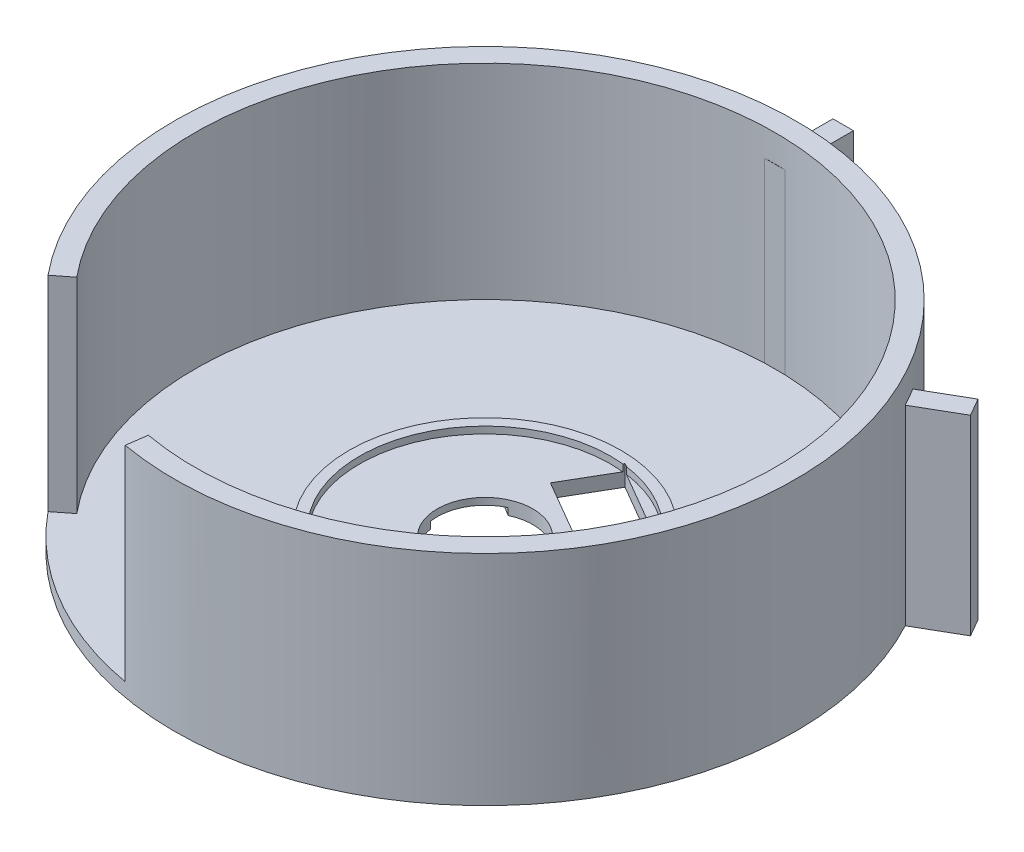
ISO-10303-21;
HEADER;
FILE_DESCRIPTION(('STEP AP214'),'2;1');
FILE_NAME('part.step','',(''),(''),'','','');
FILE_SCHEMA(('AUTOMOTIVE_DESIGN { 1 0 10303 214 1 1 1 1 }'));
ENDSEC;
DATA;
#1=APPLICATION_CONTEXT('core data for automotive mechanical design processes');
#2=APPLICATION_PROTOCOL_DEFINITION('international standard','automotive_design',2000,#1);
#3=PRODUCT_CONTEXT('',#1,'mechanical');
#4=PRODUCT('Part','Part','',(#3));
#5=PRODUCT_RELATED_PRODUCT_CATEGORY('part','',(#4));
#6=PRODUCT_DEFINITION_FORMATION('','',#4);
#7=PRODUCT_DEFINITION_CONTEXT('part definition',#1,'design');
#8=PRODUCT_DEFINITION('design','',#6,#7);
#9=PRODUCT_DEFINITION_SHAPE('','',#8);
#10=(LENGTH_UNIT() NAMED_UNIT(*) SI_UNIT(.MILLI.,.METRE.));
#11=(NAMED_UNIT(*) PLANE_ANGLE_UNIT() SI_UNIT($,.RADIAN.));
#12=(NAMED_UNIT(*) SI_UNIT($,.STERADIAN.) SOLID_ANGLE_UNIT());
#13=UNCERTAINTY_MEASURE_WITH_UNIT(LENGTH_MEASURE(1.E-05),#10,'distance_accuracy_value','');
#14=(GEOMETRIC_REPRESENTATION_CONTEXT(3) GLOBAL_UNCERTAINTY_ASSIGNED_CONTEXT((#13)) GLOBAL_UNIT_ASSIGNED_CONTEXT((#10,
#11,#12)) REPRESENTATION_CONTEXT('',''));
#15=CARTESIAN_POINT('',(0.,0.,0.));
#16=DIRECTION('',(0.,0.,1.));
#17=DIRECTION('',(1.,0.,0.));
#18=AXIS2_PLACEMENT_3D('',#15,#16,#17);
#19=CARTESIAN_POINT('',(0.,32.,0.));
#20=DIRECTION('',(0.,-1.,0.));
#21=DIRECTION('',(0.,0.,-1.));
#22=AXIS2_PLACEMENT_3D('',#19,#20,#21);
#23=CYLINDRICAL_SURFACE('',#22,42.5);
#24=CARTESIAN_POINT('',(0.,32.,0.));
#25=DIRECTION('',(0.,1.,0.));
#26=DIRECTION('',(0.,0.,1.));
#27=AXIS2_PLACEMENT_3D('',#24,#25,#26);
#28=CIRCLE('',#27,42.5);
#29=CARTESIAN_POINT('',(-7.50818253214453,32.,41.8315335012237));
#30=VERTEX_POINT('',#29);
#31=CARTESIAN_POINT('',(-32.8004509650978,32.,27.0255511782131));
#32=VERTEX_POINT('',#31);
#33=EDGE_CURVE('E461',#30,#32,#28,.T.);
#34=ORIENTED_EDGE('',*,*,#33,.T.);
#35=DIRECTION('',(0.,-1.,0.));
#36=VECTOR('',#35,1.);
#37=CARTESIAN_POINT('',(-32.8004509650978,32.,27.0255511782131));
#38=LINE('',#37,#36);
#39=CARTESIAN_POINT('',(-32.8004509650978,2.,27.0255511782131));
#40=VERTEX_POINT('',#39);
#41=EDGE_CURVE('E282',#32,#40,#38,.T.);
#42=ORIENTED_EDGE('',*,*,#41,.T.);
#43=CARTESIAN_POINT('',(0.,2.,0.));
#44=DIRECTION('',(0.,-1.,0.));
#45=DIRECTION('',(0.,0.,-1.));
#46=AXIS2_PLACEMENT_3D('',#43,#44,#45);
#47=CIRCLE('',#46,42.5);
#48=CARTESIAN_POINT('',(-1.49999999999974,2.,-42.4735211631906));
#49=VERTEX_POINT('',#48);
#50=EDGE_CURVE('E457',#40,#49,#47,.T.);
#51=ORIENTED_EDGE('',*,*,#50,.T.);
#52=DIRECTION('',(0.,1.,0.));
#53=VECTOR('',#52,1.);
#54=CARTESIAN_POINT('',(-1.49999999999974,0.,-42.4735211631906));
#55=LINE('',#54,#53);
#56=CARTESIAN_POINT('',(-1.49999999999974,28.,-42.4735211631906));
#57=VERTEX_POINT('',#56);
#58=EDGE_CURVE('E431',#49,#57,#55,.T.);
#59=ORIENTED_EDGE('',*,*,#58,.T.);
#60=CARTESIAN_POINT('',(0.,28.,0.));
#61=DIRECTION('',(0.,-1.,0.));
#62=DIRECTION('',(0.,0.,-1.));
#63=AXIS2_PLACEMENT_3D('',#60,#61,#62);
#64=CIRCLE('',#63,42.5);
#65=CARTESIAN_POINT('',(1.50000000000026,28.,-42.4735211631906));
#66=VERTEX_POINT('',#65);
#67=EDGE_CURVE('E450',#57,#66,#64,.T.);
#68=ORIENTED_EDGE('',*,*,#67,.T.);
#69=DIRECTION('',(0.,1.,0.));
#70=VECTOR('',#69,1.);
#71=CARTESIAN_POINT('',(1.50000000000026,0.,-42.4735211631906));
#72=LINE('',#71,#70);
#73=CARTESIAN_POINT('',(1.50000000000026,2.,-42.4735211631906));
#74=VERTEX_POINT('',#73);
#75=EDGE_CURVE('E430',#74,#66,#72,.T.);
#76=ORIENTED_EDGE('',*,*,#75,.F.);
#77=CARTESIAN_POINT('',(36.0331483154992,2.,-22.5357986872717));
#78=VERTEX_POINT('',#77);
#79=EDGE_CURVE('E466',#74,#78,#47,.T.);
#80=ORIENTED_EDGE('',*,*,#79,.T.);
#81=DIRECTION('',(0.,1.,0.));
#82=VECTOR('',#81,1.);
#83=CARTESIAN_POINT('',(36.0331483154992,0.,-22.5357986872717));
#84=LINE('',#83,#82);
#85=CARTESIAN_POINT('',(36.0331483154992,28.,-22.5357986872717));
#86=VERTEX_POINT('',#85);
#87=EDGE_CURVE('E381',#78,#86,#84,.T.);
#88=ORIENTED_EDGE('',*,*,#87,.T.);
#89=CARTESIAN_POINT('',(0.,28.,0.));
#90=DIRECTION('',(0.,-1.,0.));
#91=DIRECTION('',(0.,0.,-1.));
#92=AXIS2_PLACEMENT_3D('',#89,#90,#91);
#93=CIRCLE('',#92,42.5);
#94=CARTESIAN_POINT('',(37.5331483154988,28.,-19.9377224759191));
#95=VERTEX_POINT('',#94);
#96=EDGE_CURVE('E400',#86,#95,#93,.T.);
#97=ORIENTED_EDGE('',*,*,#96,.T.);
#98=DIRECTION('',(0.,1.,0.));
#99=VECTOR('',#98,1.);
#100=CARTESIAN_POINT('',(37.5331483154988,0.,-19.9377224759191));
#101=LINE('',#100,#99);
#102=CARTESIAN_POINT('',(37.5331483154988,2.,-19.9377224759191));
#103=VERTEX_POINT('',#102);
#104=EDGE_CURVE('E380',#103,#95,#101,.T.);
#105=ORIENTED_EDGE('',*,*,#104,.F.);
#106=CARTESIAN_POINT('',(-7.50818253214453,2.,41.8315335012237));
#107=VERTEX_POINT('',#106);
#108=EDGE_CURVE('E478',#103,#107,#47,.T.);
#109=ORIENTED_EDGE('',*,*,#108,.T.);
#110=DIRECTION('',(0.,-1.,0.));
#111=VECTOR('',#110,1.);
#112=CARTESIAN_POINT('',(-7.50818253214453,32.,41.8315335012237));
#113=LINE('',#112,#111);
#114=EDGE_CURVE('E274',#107,#30,#113,.F.);
#115=ORIENTED_EDGE('',*,*,#114,.T.);
#116=EDGE_LOOP('',(#34,#42,#51,#59,#68,#76,#80,#88,#97,#105,#109,#115));
#117=FACE_BOUND('',#116,.T.);
#118=ADVANCED_FACE('F39',(#117),#23,.F.);
#119=CARTESIAN_POINT('',(0.,32.,0.));
#120=DIRECTION('',(0.,1.,0.));
#121=DIRECTION('',(0.,0.,1.));
#122=AXIS2_PLACEMENT_3D('',#119,#120,#121);
#123=PLANE('',#122);
#124=CARTESIAN_POINT('',(0.,32.,0.));
#125=DIRECTION('',(0.,1.,0.));
#126=DIRECTION('',(0.,0.,1.));
#127=AXIS2_PLACEMENT_3D('',#124,#125,#126);
#128=CIRCLE('',#127,45.5);
#129=CARTESIAN_POINT('',(-7.92598309635751,32.,44.8043389858198));
#130=VERTEX_POINT('',#129);
#131=CARTESIAN_POINT('',(-35.1652264960856,32.,28.8731163104886));
#132=VERTEX_POINT('',#131);
#133=EDGE_CURVE('E467',#130,#132,#128,.T.);
#134=ORIENTED_EDGE('',*,*,#133,.T.);
#135=DIRECTION('',(0.788010753606721,0.,-0.61566147532566));
#136=VECTOR('',#135,1.);
#137=CARTESIAN_POINT('',(0.678736558687916,32.,0.868743178756121));
#138=LINE('',#137,#136);
#139=EDGE_CURVE('E278',#132,#32,#138,.T.);
#140=ORIENTED_EDGE('',*,*,#139,.T.);
#141=ORIENTED_EDGE('',*,*,#33,.F.);
#142=DIRECTION('',(-0.139173100960061,0.,0.990268068741571));
#143=VECTOR('',#142,1.);
#144=CARTESIAN_POINT('',(-1.59758876118056,32.,-0.224526458007468));
#145=LINE('',#144,#143);
#146=EDGE_CURVE('E270',#30,#130,#145,.T.);
#147=ORIENTED_EDGE('',*,*,#146,.T.);
#148=EDGE_LOOP('',(#134,#140,#141,#147));
#149=FACE_BOUND('',#148,.T.);
#150=ADVANCED_FACE('F526',(#149),#123,.T.);
#151=CARTESIAN_POINT('',(0.,32.,0.));
#152=DIRECTION('',(0.,-1.,0.));
#153=DIRECTION('',(0.,0.,-1.));
#154=AXIS2_PLACEMENT_3D('',#151,#152,#153);
#155=CYLINDRICAL_SURFACE('',#154,45.5);
#156=CARTESIAN_POINT('',(0.,28.,0.));
#157=DIRECTION('',(0.,-1.,0.));
#158=DIRECTION('',(0.,0.,-1.));
#159=AXIS2_PLACEMENT_3D('',#156,#157,#158);
#160=CIRCLE('',#159,45.5);
#161=CARTESIAN_POINT('',(38.6327373350306,28.,-24.0366721074805));
#162=VERTEX_POINT('',#161);
#163=CARTESIAN_POINT('',(40.1327373350302,28.,-21.438595896128));
#164=VERTEX_POINT('',#163);
#165=EDGE_CURVE('E490',#162,#164,#160,.T.);
#166=ORIENTED_EDGE('',*,*,#165,.F.);
#167=DIRECTION('',(0.,-1.,0.));
#168=VECTOR('',#167,1.);
#169=CARTESIAN_POINT('',(38.6327373350306,32.,-24.0366721074805));
#170=LINE('',#169,#168);
#171=CARTESIAN_POINT('',(38.6327373350306,0.,-24.0366721074805));
#172=VERTEX_POINT('',#171);
#173=EDGE_CURVE('E397',#162,#172,#170,.T.);
#174=ORIENTED_EDGE('',*,*,#173,.T.);
#175=CARTESIAN_POINT('',(0.,0.,0.));
#176=DIRECTION('',(0.,1.,0.));
#177=DIRECTION('',(0.,0.,1.));
#178=AXIS2_PLACEMENT_3D('',#175,#176,#177);
#179=CIRCLE('',#178,45.5);
#180=CARTESIAN_POINT('',(1.50000000000027,0.,-45.4752680036083));
#181=VERTEX_POINT('',#180);
#182=EDGE_CURVE('E465',#172,#181,#179,.T.);
#183=ORIENTED_EDGE('',*,*,#182,.T.);
#184=DIRECTION('',(0.,-1.,0.));
#185=VECTOR('',#184,1.);
#186=CARTESIAN_POINT('',(1.50000000000027,32.,-45.4752680036083));
#187=LINE('',#186,#185);
#188=CARTESIAN_POINT('',(1.50000000000027,28.,-45.4752680036083));
#189=VERTEX_POINT('',#188);
#190=EDGE_CURVE('E435',#181,#189,#187,.F.);
#191=ORIENTED_EDGE('',*,*,#190,.T.);
#192=CARTESIAN_POINT('',(0.,28.,0.));
#193=DIRECTION('',(0.,-1.,0.));
#194=DIRECTION('',(0.,0.,-1.));
#195=AXIS2_PLACEMENT_3D('',#192,#193,#194);
#196=CIRCLE('',#195,45.5);
#197=CARTESIAN_POINT('',(-1.49999999999972,28.,-45.4752680036083));
#198=VERTEX_POINT('',#197);
#199=EDGE_CURVE('E482',#198,#189,#196,.T.);
#200=ORIENTED_EDGE('',*,*,#199,.F.);
#201=DIRECTION('',(0.,-1.,0.));
#202=VECTOR('',#201,1.);
#203=CARTESIAN_POINT('',(-1.49999999999972,32.,-45.4752680036083));
#204=LINE('',#203,#202);
#205=CARTESIAN_POINT('',(-1.49999999999972,0.,-45.4752680036083));
#206=VERTEX_POINT('',#205);
#207=EDGE_CURVE('E447',#198,#206,#204,.T.);
#208=ORIENTED_EDGE('',*,*,#207,.T.);
#209=CARTESIAN_POINT('',(40.1327373350302,0.,-21.438595896128));
#210=VERTEX_POINT('',#209);
#211=EDGE_CURVE('E472',#206,#210,#179,.T.);
#212=ORIENTED_EDGE('',*,*,#211,.T.);
#213=DIRECTION('',(0.,-1.,0.));
#214=VECTOR('',#213,1.);
#215=CARTESIAN_POINT('',(40.1327373350302,32.,-21.438595896128));
#216=LINE('',#215,#214);
#217=EDGE_CURVE('E385',#210,#164,#216,.F.);
#218=ORIENTED_EDGE('',*,*,#217,.T.);
#219=EDGE_LOOP('',(#166,#174,#183,#191,#200,#208,#212,#218));
#220=FACE_BOUND('',#219,.T.);
#221=DIRECTION('',(0.,-1.,0.));
#222=VECTOR('',#221,1.);
#223=CARTESIAN_POINT('',(-35.1652264960856,60.5,28.8731163104886));
#224=LINE('',#223,#222);
#225=CARTESIAN_POINT('',(-35.1652264960856,2.,28.8731163104886));
#226=VERTEX_POINT('',#225);
#227=EDGE_CURVE('E267',#132,#226,#224,.T.);
#228=ORIENTED_EDGE('',*,*,#227,.F.);
#229=ORIENTED_EDGE('',*,*,#133,.F.);
#230=DIRECTION('',(0.,-1.,0.));
#231=VECTOR('',#230,1.);
#232=CARTESIAN_POINT('',(-7.92598309635751,60.5,44.8043389858198));
#233=LINE('',#232,#231);
#234=CARTESIAN_POINT('',(-7.92598309635751,2.,44.8043389858198));
#235=VERTEX_POINT('',#234);
#236=EDGE_CURVE('E263',#130,#235,#233,.T.);
#237=ORIENTED_EDGE('',*,*,#236,.T.);
#238=CARTESIAN_POINT('',(0.,2.,0.));
#239=DIRECTION('',(0.,-1.,0.));
#240=DIRECTION('',(0.,0.,-1.));
#241=AXIS2_PLACEMENT_3D('',#238,#239,#240);
#242=CIRCLE('',#241,45.5);
#243=EDGE_CURVE('E231',#235,#226,#242,.T.);
#244=ORIENTED_EDGE('',*,*,#243,.T.);
#245=EDGE_LOOP('',(#228,#229,#237,#244));
#246=FACE_BOUND('',#245,.T.);
#247=ADVANCED_FACE('F41',(#220,#246),#155,.T.);
#248=CARTESIAN_POINT('',(0.,2.,0.));
#249=DIRECTION('',(0.,-1.,0.));
#250=DIRECTION('',(0.,0.,-1.));
#251=AXIS2_PLACEMENT_3D('',#248,#249,#250);
#252=PLANE('',#251);
#253=CARTESIAN_POINT('',(0.,2.,0.));
#254=DIRECTION('',(0.,1.,0.));
#255=DIRECTION('',(0.,0.,1.));
#256=AXIS2_PLACEMENT_3D('',#253,#254,#255);
#257=CIRCLE('',#256,7.);
#258=CARTESIAN_POINT('',(0.,2.,7.));
#259=VERTEX_POINT('',#258);
#260=EDGE_CURVE('E454',#259,#259,#257,.T.);
#261=ORIENTED_EDGE('',*,*,#260,.F.);
#262=EDGE_LOOP('',(#261));
#263=FACE_BOUND('',#262,.T.);
#264=DIRECTION('',(-0.864345338631781,0.,-0.502898732932895));
#265=VECTOR('',#264,1.);
#266=CARTESIAN_POINT('',(4.52608859639606,2.,-7.77910804768603));
#267=LINE('',#266,#265);
#268=CARTESIAN_POINT('',(10.9586774046728,2.,-4.03645957539663));
#269=VERTEX_POINT('',#268);
#270=CARTESIAN_POINT('',(-2.00650267480392,2.,-11.5799405693901));
#271=VERTEX_POINT('',#270);
#272=EDGE_CURVE('E336',#269,#271,#267,.T.);
#273=ORIENTED_EDGE('',*,*,#272,.T.);
#274=DIRECTION('',(0.502898732932895,0.,-0.864345338631781));
#275=VECTOR('',#274,1.);
#276=CARTESIAN_POINT('',(-6.53259127119998,2.,-3.80083252170404));
#277=LINE('',#276,#275);
#278=CARTESIAN_POINT('',(1.89868436966206,2.,-18.2918887158568));
#279=VERTEX_POINT('',#278);
#280=EDGE_CURVE('E332',#271,#279,#277,.T.);
#281=ORIENTED_EDGE('',*,*,#280,.T.);
#282=CARTESIAN_POINT('',(0.,2.,0.));
#283=DIRECTION('',(0.,1.,0.));
#284=DIRECTION('',(0.,0.,1.));
#285=AXIS2_PLACEMENT_3D('',#282,#283,#284);
#286=CIRCLE('',#285,18.3901657178201);
#287=CARTESIAN_POINT('',(14.8898530942682,2.,-10.7930750928546));
#288=VERTEX_POINT('',#287);
#289=EDGE_CURVE('E340',#279,#288,#286,.T.);
#290=ORIENTED_EDGE('',*,*,#289,.T.);
#291=DIRECTION('',(-0.502898732932895,0.,0.864345338631781));
#292=VECTOR('',#291,1.);
#293=CARTESIAN_POINT('',(6.43258880827674,2.,3.7426484722894));
#294=LINE('',#293,#292);
#295=EDGE_CURVE('E325',#288,#269,#294,.T.);
#296=ORIENTED_EDGE('',*,*,#295,.T.);
#297=EDGE_LOOP('',(#273,#281,#290,#296));
#298=FACE_BOUND('',#297,.T.);
#299=ADVANCED_FACE('F600',(#263,#298),#252,.F.);
#300=CARTESIAN_POINT('',(0.,3.,0.));
#301=DIRECTION('',(0.,-1.,0.));
#302=DIRECTION('',(0.,0.,-1.));
#303=AXIS2_PLACEMENT_3D('',#300,#301,#302);
#304=CYLINDRICAL_SURFACE('',#303,18.3901657178201);
#305=DIRECTION('',(0.,-1.,0.));
#306=VECTOR('',#305,1.);
#307=CARTESIAN_POINT('',(1.89868436966206,3.,-18.2918887158568));
#308=LINE('',#307,#306);
#309=CARTESIAN_POINT('',(1.89868436966206,3.,-18.2918887158568));
#310=VERTEX_POINT('',#309);
#311=EDGE_CURVE('E507',#310,#279,#308,.T.);
#312=ORIENTED_EDGE('',*,*,#311,.F.);
#313=CARTESIAN_POINT('',(0.,3.,0.));
#314=DIRECTION('',(0.,1.,0.));
#315=DIRECTION('',(0.,0.,1.));
#316=AXIS2_PLACEMENT_3D('',#313,#314,#315);
#317=CIRCLE('',#316,18.3901657178201);
#318=CARTESIAN_POINT('',(14.8898530942682,3.,-10.7930750928546));
#319=VERTEX_POINT('',#318);
#320=EDGE_CURVE('E341',#310,#319,#317,.T.);
#321=ORIENTED_EDGE('',*,*,#320,.T.);
#322=DIRECTION('',(0.,-1.,0.));
#323=VECTOR('',#322,1.);
#324=CARTESIAN_POINT('',(14.8898530942682,3.,-10.7930750928546));
#325=LINE('',#324,#323);
#326=EDGE_CURVE('E504',#288,#319,#325,.F.);
#327=ORIENTED_EDGE('',*,*,#326,.F.);
#328=ORIENTED_EDGE('',*,*,#289,.F.);
#329=EDGE_LOOP('',(#312,#321,#327,#328));
#330=FACE_BOUND('',#329,.T.);
#331=ADVANCED_FACE('F601',(#330),#304,.F.);
#332=CARTESIAN_POINT('',(14.6119198415396,2.,-11.1664673766285));
#333=VERTEX_POINT('',#332);
#334=CARTESIAN_POINT('',(2.48663707817889,2.,-18.221274136852));
#335=VERTEX_POINT('',#334);
#336=EDGE_CURVE('E346',#333,#335,#286,.T.);
#337=ORIENTED_EDGE('',*,*,#336,.T.);
#338=DIRECTION('',(0.864345338631781,0.,0.502898732932895));
#339=VECTOR('',#338,1.);
#340=CARTESIAN_POINT('',(8.54927845985922,2.,-14.6938707567403));
#341=LINE('',#340,#339);
#342=EDGE_CURVE('E317',#335,#333,#341,.T.);
#343=ORIENTED_EDGE('',*,*,#342,.T.);
#344=EDGE_LOOP('',(#337,#343));
#345=FACE_BOUND('',#344,.T.);
#346=ADVANCED_FACE('F594',(#345),#252,.F.);
#347=CARTESIAN_POINT('',(0.,0.,0.));
#348=DIRECTION('',(0.,1.,0.));
#349=DIRECTION('',(0.,0.,1.));
#350=AXIS2_PLACEMENT_3D('',#347,#348,#349);
#351=PLANE('',#350);
#352=DIRECTION('',(0.864345338631781,0.,0.502898732932895));
#353=VECTOR('',#352,1.);
#354=CARTESIAN_POINT('',(2.01668718865924,0.,-18.4947032784443));
#355=LINE('',#354,#353);
#356=CARTESIAN_POINT('',(2.01668718865924,0.,-18.4947032784443));
#357=VERTEX_POINT('',#356);
#358=CARTESIAN_POINT('',(14.981867268136,0.,-10.9512222844509));
#359=VERTEX_POINT('',#358);
#360=EDGE_CURVE('E289',#357,#359,#355,.T.);
#361=ORIENTED_EDGE('',*,*,#360,.F.);
#362=DIRECTION('',(0.502898732932895,0.,-0.864345338631781));
#363=VECTOR('',#362,1.);
#364=CARTESIAN_POINT('',(2.01668718865924,0.,-18.4947032784443));
#365=LINE('',#364,#363);
#366=CARTESIAN_POINT('',(-2.00650267480392,0.,-11.5799405693901));
#367=VERTEX_POINT('',#366);
#368=EDGE_CURVE('E286',#367,#357,#365,.T.);
#369=ORIENTED_EDGE('',*,*,#368,.F.);
#370=DIRECTION('',(-0.864345338631781,0.,-0.502898732932895));
#371=VECTOR('',#370,1.);
#372=CARTESIAN_POINT('',(-2.00650267480392,0.,-11.5799405693901));
#373=LINE('',#372,#371);
#374=CARTESIAN_POINT('',(10.9586774046728,0.,-4.03645957539663));
#375=VERTEX_POINT('',#374);
#376=EDGE_CURVE('E297',#375,#367,#373,.T.);
#377=ORIENTED_EDGE('',*,*,#376,.F.);
#378=DIRECTION('',(-0.502898732932896,0.,0.864345338631781));
#379=VECTOR('',#378,1.);
#380=CARTESIAN_POINT('',(14.981867268136,0.,-10.9512222844509));
#381=LINE('',#380,#379);
#382=EDGE_CURVE('E293',#359,#375,#381,.T.);
#383=ORIENTED_EDGE('',*,*,#382,.F.);
#384=EDGE_LOOP('',(#361,#369,#377,#383));
#385=FACE_BOUND('',#384,.T.);
#386=CARTESIAN_POINT('',(0.,0.,0.));
#387=DIRECTION('',(0.,1.,0.));
#388=DIRECTION('',(0.,0.,1.));
#389=AXIS2_PLACEMENT_3D('',#386,#387,#388);
#390=CIRCLE('',#389,7.);
#391=CARTESIAN_POINT('',(-6.91226534619207,0.,1.10480214691692));
#392=VERTEX_POINT('',#391);
#393=CARTESIAN_POINT('',(-2.96019924007833,0.,-6.34328152134522));
#394=VERTEX_POINT('',#393);
#395=EDGE_CURVE('E247',#392,#394,#390,.T.);
#396=ORIENTED_EDGE('',*,*,#395,.T.);
#397=DIRECTION('',(0.85293682845598,0.,0.522014144122028));
#398=VECTOR('',#397,1.);
#399=CARTESIAN_POINT('',(-2.51910953449813,0.,-6.07332593089862));
#400=LINE('',#399,#398);
#401=CARTESIAN_POINT('',(-19.8144830178494,0.,-16.6584352672208));
#402=VERTEX_POINT('',#401);
#403=EDGE_CURVE('E241',#402,#394,#400,.T.);
#404=ORIENTED_EDGE('',*,*,#403,.F.);
#405=DIRECTION('',(0.522014144122029,0.,-0.85293682845598));
#406=VECTOR('',#405,1.);
#407=CARTESIAN_POINT('',(-24.2076388295433,0.,-9.48030718940525));
#408=LINE('',#407,#406);
#409=CARTESIAN_POINT('',(-24.2076388295433,0.,-9.48030718940525));
#410=VERTEX_POINT('',#409);
#411=EDGE_CURVE('E611',#410,#402,#408,.T.);
#412=ORIENTED_EDGE('',*,*,#411,.F.);
#413=DIRECTION('',(-0.85293682845598,0.,-0.522014144122028));
#414=VECTOR('',#413,1.);
#415=CARTESIAN_POINT('',(-6.91226534619207,0.,1.10480214691692));
#416=LINE('',#415,#414);
#417=EDGE_CURVE('E609',#392,#410,#416,.T.);
#418=ORIENTED_EDGE('',*,*,#417,.F.);
#419=EDGE_LOOP('',(#396,#404,#412,#418));
#420=FACE_BOUND('',#419,.T.);
#421=ORIENTED_EDGE('',*,*,#182,.F.);
#422=DIRECTION('',(-0.866025403784438,0.,0.500000000000001));
#423=VECTOR('',#422,1.);
#424=CARTESIAN_POINT('',(44.6934023533436,0.,-27.5357986872717));
#425=LINE('',#424,#423);
#426=CARTESIAN_POINT('',(44.6934023533436,0.,-27.5357986872717));
#427=VERTEX_POINT('',#426);
#428=EDGE_CURVE('E376',#427,#172,#425,.T.);
#429=ORIENTED_EDGE('',*,*,#428,.F.);
#430=DIRECTION('',(-0.500000000000001,0.,-0.866025403784438));
#431=VECTOR('',#430,1.);
#432=CARTESIAN_POINT('',(46.1934023533432,0.,-24.9377224759191));
#433=LINE('',#432,#431);
#434=CARTESIAN_POINT('',(46.1934023533432,0.,-24.9377224759191));
#435=VERTEX_POINT('',#434);
#436=EDGE_CURVE('E372',#435,#427,#433,.T.);
#437=ORIENTED_EDGE('',*,*,#436,.F.);
#438=DIRECTION('',(0.866025403784438,0.,-0.500000000000001));
#439=VECTOR('',#438,1.);
#440=CARTESIAN_POINT('',(46.1934023533432,0.,-24.9377224759191));
#441=LINE('',#440,#439);
#442=EDGE_CURVE('E369',#210,#435,#441,.T.);
#443=ORIENTED_EDGE('',*,*,#442,.F.);
#444=ORIENTED_EDGE('',*,*,#211,.F.);
#445=DIRECTION('',(0.,0.,1.));
#446=VECTOR('',#445,1.);
#447=CARTESIAN_POINT('',(-1.49999999999968,0.,-52.4735211631906));
#448=LINE('',#447,#446);
#449=CARTESIAN_POINT('',(-1.49999999999968,0.,-52.4735211631906));
#450=VERTEX_POINT('',#449);
#451=EDGE_CURVE('E426',#450,#206,#448,.T.);
#452=ORIENTED_EDGE('',*,*,#451,.F.);
#453=DIRECTION('',(-1.,0.,0.));
#454=VECTOR('',#453,1.);
#455=CARTESIAN_POINT('',(1.50000000000032,0.,-52.4735211631906));
#456=LINE('',#455,#454);
#457=CARTESIAN_POINT('',(1.50000000000032,0.,-52.4735211631906));
#458=VERTEX_POINT('',#457);
#459=EDGE_CURVE('E422',#458,#450,#456,.T.);
#460=ORIENTED_EDGE('',*,*,#459,.F.);
#461=DIRECTION('',(0.,0.,-1.));
#462=VECTOR('',#461,1.);
#463=CARTESIAN_POINT('',(1.50000000000032,0.,-52.4735211631906));
#464=LINE('',#463,#462);
#465=EDGE_CURVE('E419',#181,#458,#464,.T.);
#466=ORIENTED_EDGE('',*,*,#465,.F.);
#467=EDGE_LOOP('',(#421,#429,#437,#443,#444,#452,#460,#466));
#468=FACE_BOUND('',#467,.T.);
#469=ADVANCED_FACE('F546',(#385,#420,#468),#351,.F.);
#470=ORIENTED_EDGE('',*,*,#50,.F.);
#471=DIRECTION('',(-0.788010753606721,0.,0.61566147532566));
#472=VECTOR('',#471,1.);
#473=CARTESIAN_POINT('',(-32.6066002919151,2.,26.8740984335667));
#474=LINE('',#473,#472);
#475=EDGE_CURVE('E63',#40,#226,#474,.T.);
#476=ORIENTED_EDGE('',*,*,#475,.T.);
#477=ORIENTED_EDGE('',*,*,#243,.F.);
#478=DIRECTION('',(0.139173100960061,0.,-0.990268068741571));
#479=VECTOR('',#478,1.);
#480=CARTESIAN_POINT('',(-7.49515502918447,2.,41.7388380011034));
#481=LINE('',#480,#479);
#482=EDGE_CURVE('E259',#235,#107,#481,.T.);
#483=ORIENTED_EDGE('',*,*,#482,.T.);
#484=ORIENTED_EDGE('',*,*,#108,.F.);
#485=DIRECTION('',(-0.500000000000004,0.,-0.866025403784437));
#486=VECTOR('',#485,1.);
#487=CARTESIAN_POINT('',(36.783148315499,2.,-21.2367605815955));
#488=LINE('',#487,#486);
#489=EDGE_CURVE('E486',#103,#78,#488,.T.);
#490=ORIENTED_EDGE('',*,*,#489,.T.);
#491=ORIENTED_EDGE('',*,*,#79,.F.);
#492=DIRECTION('',(-1.,0.,0.));
#493=VECTOR('',#492,1.);
#494=CARTESIAN_POINT('',(2.94719257076738E-13,2.,-42.4735211631906));
#495=LINE('',#494,#493);
#496=EDGE_CURVE('E471',#74,#49,#495,.T.);
#497=ORIENTED_EDGE('',*,*,#496,.T.);
#498=EDGE_LOOP('',(#470,#476,#477,#483,#484,#490,#491,#497));
#499=FACE_BOUND('',#498,.T.);
#500=CARTESIAN_POINT('',(0.,2.,0.));
#501=DIRECTION('',(0.,-1.,0.));
#502=DIRECTION('',(0.,0.,-1.));
#503=AXIS2_PLACEMENT_3D('',#500,#501,#502);
#504=CIRCLE('',#503,19.8901657178201);
#505=CARTESIAN_POINT('',(0.,2.,-19.8901657178201));
#506=VERTEX_POINT('',#505);
#507=EDGE_CURVE('E494',#506,#506,#504,.F.);
#508=ORIENTED_EDGE('',*,*,#507,.F.);
#509=EDGE_LOOP('',(#508));
#510=FACE_BOUND('',#509,.T.);
#511=ADVANCED_FACE('F516',(#499,#510),#252,.F.);
#512=CARTESIAN_POINT('',(0.,0.,0.));
#513=DIRECTION('',(0.,1.,0.));
#514=DIRECTION('',(0.,0.,1.));
#515=AXIS2_PLACEMENT_3D('',#512,#513,#514);
#516=CYLINDRICAL_SURFACE('',#515,7.);
#517=CARTESIAN_POINT('',(0.,1.,0.));
#518=DIRECTION('',(0.,1.,0.));
#519=DIRECTION('',(0.,0.,1.));
#520=AXIS2_PLACEMENT_3D('',#517,#518,#519);
#521=CIRCLE('',#520,7.);
#522=CARTESIAN_POINT('',(-6.91226534619207,1.,1.10480214691692));
#523=VERTEX_POINT('',#522);
#524=CARTESIAN_POINT('',(-2.96019924007833,1.,-6.34328152134522));
#525=VERTEX_POINT('',#524);
#526=EDGE_CURVE('E48',#523,#525,#521,.F.);
#527=ORIENTED_EDGE('',*,*,#526,.T.);
#528=DIRECTION('',(0.,1.,0.));
#529=VECTOR('',#528,1.);
#530=CARTESIAN_POINT('',(-2.96019924007833,0.,-6.34328152134522));
#531=LINE('',#530,#529);
#532=EDGE_CURVE('E11',#525,#394,#531,.F.);
#533=ORIENTED_EDGE('',*,*,#532,.T.);
#534=ORIENTED_EDGE('',*,*,#395,.F.);
#535=DIRECTION('',(0.,-1.,0.));
#536=VECTOR('',#535,1.);
#537=CARTESIAN_POINT('',(-6.91226534619207,1.,1.10480214691692));
#538=LINE('',#537,#536);
#539=EDGE_CURVE('E235',#523,#392,#538,.T.);
#540=ORIENTED_EDGE('',*,*,#539,.F.);
#541=EDGE_LOOP('',(#527,#533,#534,#540));
#542=FACE_BOUND('',#541,.T.);
#543=ORIENTED_EDGE('',*,*,#260,.T.);
#544=EDGE_LOOP('',(#543));
#545=FACE_BOUND('',#544,.T.);
#546=ADVANCED_FACE('F244',(#542,#545),#516,.F.);
#547=CARTESIAN_POINT('',(-1.49999999999974,0.,-42.4735211631906));
#548=DIRECTION('',(0.,0.,1.));
#549=DIRECTION('',(1.,0.,0.));
#550=AXIS2_PLACEMENT_3D('',#547,#548,#549);
#551=PLANE('',#550);
#552=ORIENTED_EDGE('',*,*,#496,.F.);
#553=ORIENTED_EDGE('',*,*,#75,.T.);
#554=DIRECTION('',(1.,0.,0.));
#555=VECTOR('',#554,1.);
#556=CARTESIAN_POINT('',(-1.49999999999974,28.,-42.4735211631906));
#557=LINE('',#556,#555);
#558=EDGE_CURVE('E404',#57,#66,#557,.T.);
#559=ORIENTED_EDGE('',*,*,#558,.F.);
#560=ORIENTED_EDGE('',*,*,#58,.F.);
#561=EDGE_LOOP('',(#552,#553,#559,#560));
#562=FACE_BOUND('',#561,.T.);
#563=ADVANCED_FACE('F685',(#562),#551,.T.);
#564=CARTESIAN_POINT('',(0.,28.,0.));
#565=DIRECTION('',(0.,-1.,0.));
#566=DIRECTION('',(0.,0.,-1.));
#567=AXIS2_PLACEMENT_3D('',#564,#565,#566);
#568=PLANE('',#567);
#569=ORIENTED_EDGE('',*,*,#67,.F.);
#570=ORIENTED_EDGE('',*,*,#558,.T.);
#571=EDGE_LOOP('',(#569,#570));
#572=FACE_BOUND('',#571,.T.);
#573=ADVANCED_FACE('F678',(#572),#568,.F.);
#574=CARTESIAN_POINT('',(-1.49999999999968,0.,-52.4735211631906));
#575=DIRECTION('',(-1.,0.,0.));
#576=DIRECTION('',(0.,0.,1.));
#577=AXIS2_PLACEMENT_3D('',#574,#575,#576);
#578=PLANE('',#577);
#579=ORIENTED_EDGE('',*,*,#207,.F.);
#580=DIRECTION('',(0.,0.,1.));
#581=VECTOR('',#580,1.);
#582=CARTESIAN_POINT('',(-1.49999999999968,28.,-52.4735211631906));
#583=LINE('',#582,#581);
#584=CARTESIAN_POINT('',(-1.49999999999968,28.,-52.4735211631906));
#585=VERTEX_POINT('',#584);
#586=EDGE_CURVE('E415',#585,#198,#583,.T.);
#587=ORIENTED_EDGE('',*,*,#586,.F.);
#588=DIRECTION('',(0.,1.,0.));
#589=VECTOR('',#588,1.);
#590=CARTESIAN_POINT('',(-1.49999999999968,0.,-52.4735211631906));
#591=LINE('',#590,#589);
#592=EDGE_CURVE('E436',#450,#585,#591,.T.);
#593=ORIENTED_EDGE('',*,*,#592,.F.);
#594=ORIENTED_EDGE('',*,*,#451,.T.);
#595=EDGE_LOOP('',(#579,#587,#593,#594));
#596=FACE_BOUND('',#595,.T.);
#597=ADVANCED_FACE('F557',(#596),#578,.T.);
#598=CARTESIAN_POINT('',(1.50000000000032,0.,-52.4735211631906));
#599=DIRECTION('',(1.,0.,0.));
#600=DIRECTION('',(0.,0.,-1.));
#601=AXIS2_PLACEMENT_3D('',#598,#599,#600);
#602=PLANE('',#601);
#603=ORIENTED_EDGE('',*,*,#190,.F.);
#604=ORIENTED_EDGE('',*,*,#465,.T.);
#605=DIRECTION('',(0.,1.,0.));
#606=VECTOR('',#605,1.);
#607=CARTESIAN_POINT('',(1.50000000000032,0.,-52.4735211631906));
#608=LINE('',#607,#606);
#609=CARTESIAN_POINT('',(1.50000000000032,28.,-52.4735211631906));
#610=VERTEX_POINT('',#609);
#611=EDGE_CURVE('E439',#458,#610,#608,.T.);
#612=ORIENTED_EDGE('',*,*,#611,.T.);
#613=DIRECTION('',(0.,0.,-1.));
#614=VECTOR('',#613,1.);
#615=CARTESIAN_POINT('',(1.50000000000032,28.,-52.4735211631906));
#616=LINE('',#615,#614);
#617=EDGE_CURVE('E408',#189,#610,#616,.T.);
#618=ORIENTED_EDGE('',*,*,#617,.F.);
#619=EDGE_LOOP('',(#603,#604,#612,#618));
#620=FACE_BOUND('',#619,.T.);
#621=ADVANCED_FACE('F543',(#620),#602,.T.);
#622=CARTESIAN_POINT('',(1.50000000000032,0.,-52.4735211631906));
#623=DIRECTION('',(0.,0.,-1.));
#624=DIRECTION('',(-1.,0.,0.));
#625=AXIS2_PLACEMENT_3D('',#622,#623,#624);
#626=PLANE('',#625);
#627=ORIENTED_EDGE('',*,*,#592,.T.);
#628=DIRECTION('',(-1.,0.,0.));
#629=VECTOR('',#628,1.);
#630=CARTESIAN_POINT('',(1.50000000000032,28.,-52.4735211631906));
#631=LINE('',#630,#629);
#632=EDGE_CURVE('E411',#610,#585,#631,.T.);
#633=ORIENTED_EDGE('',*,*,#632,.F.);
#634=ORIENTED_EDGE('',*,*,#611,.F.);
#635=ORIENTED_EDGE('',*,*,#459,.T.);
#636=EDGE_LOOP('',(#627,#633,#634,#635));
#637=FACE_BOUND('',#636,.T.);
#638=ADVANCED_FACE('F550',(#637),#626,.T.);
#639=ORIENTED_EDGE('',*,*,#586,.T.);
#640=ORIENTED_EDGE('',*,*,#199,.T.);
#641=ORIENTED_EDGE('',*,*,#617,.T.);
#642=ORIENTED_EDGE('',*,*,#632,.T.);
#643=EDGE_LOOP('',(#639,#640,#641,#642));
#644=FACE_BOUND('',#643,.T.);
#645=ADVANCED_FACE('F554',(#644),#568,.F.);
#646=CARTESIAN_POINT('',(36.0331483154992,0.,-22.5357986872717));
#647=DIRECTION('',(-0.866025403784437,0.,0.500000000000003));
#648=DIRECTION('',(0.500000000000004,0.,0.866025403784437));
#649=AXIS2_PLACEMENT_3D('',#646,#647,#648);
#650=PLANE('',#649);
#651=ORIENTED_EDGE('',*,*,#489,.F.);
#652=ORIENTED_EDGE('',*,*,#104,.T.);
#653=DIRECTION('',(0.500000000000003,0.,0.866025403784437));
#654=VECTOR('',#653,1.);
#655=CARTESIAN_POINT('',(36.0331483154992,28.,-22.5357986872717));
#656=LINE('',#655,#654);
#657=EDGE_CURVE('E354',#86,#95,#656,.T.);
#658=ORIENTED_EDGE('',*,*,#657,.F.);
#659=ORIENTED_EDGE('',*,*,#87,.F.);
#660=EDGE_LOOP('',(#651,#652,#658,#659));
#661=FACE_BOUND('',#660,.T.);
#662=ADVANCED_FACE('F581',(#661),#650,.T.);
#663=CARTESIAN_POINT('',(0.,28.,0.));
#664=DIRECTION('',(0.,-1.,0.));
#665=DIRECTION('',(0.,0.,-1.));
#666=AXIS2_PLACEMENT_3D('',#663,#664,#665);
#667=PLANE('',#666);
#668=ORIENTED_EDGE('',*,*,#96,.F.);
#669=ORIENTED_EDGE('',*,*,#657,.T.);
#670=EDGE_LOOP('',(#668,#669));
#671=FACE_BOUND('',#670,.T.);
#672=ADVANCED_FACE('F574',(#671),#667,.F.);
#673=CARTESIAN_POINT('',(44.6934023533436,0.,-27.5357986872717));
#674=DIRECTION('',(-0.500000000000001,0.,-0.866025403784438));
#675=DIRECTION('',(-0.866025403784438,0.,0.500000000000001));
#676=AXIS2_PLACEMENT_3D('',#673,#674,#675);
#677=PLANE('',#676);
#678=ORIENTED_EDGE('',*,*,#173,.F.);
#679=DIRECTION('',(-0.866025403784438,0.,0.500000000000001));
#680=VECTOR('',#679,1.);
#681=CARTESIAN_POINT('',(44.6934023533436,28.,-27.5357986872717));
#682=LINE('',#681,#680);
#683=CARTESIAN_POINT('',(44.6934023533436,28.,-27.5357986872717));
#684=VERTEX_POINT('',#683);
#685=EDGE_CURVE('E365',#684,#162,#682,.T.);
#686=ORIENTED_EDGE('',*,*,#685,.F.);
#687=DIRECTION('',(0.,1.,0.));
#688=VECTOR('',#687,1.);
#689=CARTESIAN_POINT('',(44.6934023533436,0.,-27.5357986872717));
#690=LINE('',#689,#688);
#691=EDGE_CURVE('E386',#427,#684,#690,.T.);
#692=ORIENTED_EDGE('',*,*,#691,.F.);
#693=ORIENTED_EDGE('',*,*,#428,.T.);
#694=EDGE_LOOP('',(#678,#686,#692,#693));
#695=FACE_BOUND('',#694,.T.);
#696=ADVANCED_FACE('F572',(#695),#677,.T.);
#697=CARTESIAN_POINT('',(46.1934023533432,0.,-24.9377224759191));
#698=DIRECTION('',(0.500000000000001,0.,0.866025403784438));
#699=DIRECTION('',(0.866025403784438,0.,-0.500000000000001));
#700=AXIS2_PLACEMENT_3D('',#697,#698,#699);
#701=PLANE('',#700);
#702=ORIENTED_EDGE('',*,*,#217,.F.);
#703=ORIENTED_EDGE('',*,*,#442,.T.);
#704=DIRECTION('',(0.,1.,0.));
#705=VECTOR('',#704,1.);
#706=CARTESIAN_POINT('',(46.1934023533432,0.,-24.9377224759191));
#707=LINE('',#706,#705);
#708=CARTESIAN_POINT('',(46.1934023533432,28.,-24.9377224759191));
#709=VERTEX_POINT('',#708);
#710=EDGE_CURVE('E389',#435,#709,#707,.T.);
#711=ORIENTED_EDGE('',*,*,#710,.T.);
#712=DIRECTION('',(0.866025403784438,0.,-0.500000000000001));
#713=VECTOR('',#712,1.);
#714=CARTESIAN_POINT('',(46.1934023533432,28.,-24.9377224759191));
#715=LINE('',#714,#713);
#716=EDGE_CURVE('E358',#164,#709,#715,.T.);
#717=ORIENTED_EDGE('',*,*,#716,.F.);
#718=EDGE_LOOP('',(#702,#703,#711,#717));
#719=FACE_BOUND('',#718,.T.);
#720=ADVANCED_FACE('F563',(#719),#701,.T.);
#721=CARTESIAN_POINT('',(46.1934023533432,0.,-24.9377224759191));
#722=DIRECTION('',(0.866025403784438,0.,-0.500000000000001));
#723=DIRECTION('',(-0.500000000000001,0.,-0.866025403784438));
#724=AXIS2_PLACEMENT_3D('',#721,#722,#723);
#725=PLANE('',#724);
#726=ORIENTED_EDGE('',*,*,#691,.T.);
#727=DIRECTION('',(-0.500000000000001,0.,-0.866025403784438));
#728=VECTOR('',#727,1.);
#729=CARTESIAN_POINT('',(46.1934023533432,28.,-24.9377224759191));
#730=LINE('',#729,#728);
#731=EDGE_CURVE('E361',#709,#684,#730,.T.);
#732=ORIENTED_EDGE('',*,*,#731,.F.);
#733=ORIENTED_EDGE('',*,*,#710,.F.);
#734=ORIENTED_EDGE('',*,*,#436,.T.);
#735=EDGE_LOOP('',(#726,#732,#733,#734));
#736=FACE_BOUND('',#735,.T.);
#737=ADVANCED_FACE('F567',(#736),#725,.T.);
#738=ORIENTED_EDGE('',*,*,#685,.T.);
#739=ORIENTED_EDGE('',*,*,#165,.T.);
#740=ORIENTED_EDGE('',*,*,#716,.T.);
#741=ORIENTED_EDGE('',*,*,#731,.T.);
#742=EDGE_LOOP('',(#738,#739,#740,#741));
#743=FACE_BOUND('',#742,.T.);
#744=ADVANCED_FACE('F570',(#743),#667,.F.);
#745=CARTESIAN_POINT('',(0.,3.,0.));
#746=DIRECTION('',(0.,1.,0.));
#747=DIRECTION('',(0.,0.,1.));
#748=AXIS2_PLACEMENT_3D('',#745,#746,#747);
#749=PLANE('',#748);
#750=DIRECTION('',(0.502898732932895,0.,-0.864345338631781));
#751=VECTOR('',#750,1.);
#752=CARTESIAN_POINT('',(6.43258880827674,3.,3.7426484722894));
#753=LINE('',#752,#751);
#754=CARTESIAN_POINT('',(14.981867268136,3.,-10.9512222844509));
#755=VERTEX_POINT('',#754);
#756=EDGE_CURVE('E322',#319,#755,#753,.T.);
#757=ORIENTED_EDGE('',*,*,#756,.F.);
#758=ORIENTED_EDGE('',*,*,#320,.F.);
#759=DIRECTION('',(-0.502898732932895,0.,0.864345338631781));
#760=VECTOR('',#759,1.);
#761=CARTESIAN_POINT('',(-6.53259127119998,3.,-3.80083252170404));
#762=LINE('',#761,#760);
#763=CARTESIAN_POINT('',(2.01668718865924,3.,-18.4947032784443));
#764=VERTEX_POINT('',#763);
#765=EDGE_CURVE('E329',#764,#310,#762,.T.);
#766=ORIENTED_EDGE('',*,*,#765,.F.);
#767=DIRECTION('',(-0.864345338631781,0.,-0.502898732932895));
#768=VECTOR('',#767,1.);
#769=CARTESIAN_POINT('',(8.54927845985922,3.,-14.6938707567403));
#770=LINE('',#769,#768);
#771=CARTESIAN_POINT('',(2.48663707817889,3.,-18.221274136852));
#772=VERTEX_POINT('',#771);
#773=EDGE_CURVE('E305',#772,#764,#770,.T.);
#774=ORIENTED_EDGE('',*,*,#773,.F.);
#775=CARTESIAN_POINT('',(14.6119198415396,3.,-11.1664673766285));
#776=VERTEX_POINT('',#775);
#777=EDGE_CURVE('E345',#776,#772,#317,.T.);
#778=ORIENTED_EDGE('',*,*,#777,.F.);
#779=EDGE_CURVE('E318',#755,#776,#770,.T.);
#780=ORIENTED_EDGE('',*,*,#779,.F.);
#781=EDGE_LOOP('',(#757,#758,#766,#774,#778,#780));
#782=FACE_BOUND('',#781,.T.);
#783=CARTESIAN_POINT('',(0.,3.,0.));
#784=DIRECTION('',(0.,1.,0.));
#785=DIRECTION('',(0.,0.,1.));
#786=AXIS2_PLACEMENT_3D('',#783,#784,#785);
#787=CIRCLE('',#786,19.8901657178201);
#788=CARTESIAN_POINT('',(0.,3.,19.8901657178201));
#789=VERTEX_POINT('',#788);
#790=EDGE_CURVE('E350',#789,#789,#787,.T.);
#791=ORIENTED_EDGE('',*,*,#790,.T.);
#792=EDGE_LOOP('',(#791));
#793=FACE_BOUND('',#792,.T.);
#794=ADVANCED_FACE('F660',(#782,#793),#749,.T.);
#795=CARTESIAN_POINT('',(0.,3.,0.));
#796=DIRECTION('',(0.,-1.,0.));
#797=DIRECTION('',(0.,0.,-1.));
#798=AXIS2_PLACEMENT_3D('',#795,#796,#797);
#799=CYLINDRICAL_SURFACE('',#798,19.8901657178201);
#800=ORIENTED_EDGE('',*,*,#790,.F.);
#801=EDGE_LOOP('',(#800));
#802=FACE_BOUND('',#801,.T.);
#803=ORIENTED_EDGE('',*,*,#507,.T.);
#804=EDGE_LOOP('',(#803));
#805=FACE_BOUND('',#804,.T.);
#806=ADVANCED_FACE('F658',(#802,#805),#799,.T.);
#807=DIRECTION('',(0.,-1.,0.));
#808=VECTOR('',#807,1.);
#809=CARTESIAN_POINT('',(14.6119198415396,3.,-11.1664673766285));
#810=LINE('',#809,#808);
#811=EDGE_CURVE('E501',#776,#333,#810,.T.);
#812=ORIENTED_EDGE('',*,*,#811,.F.);
#813=ORIENTED_EDGE('',*,*,#777,.T.);
#814=DIRECTION('',(0.,-1.,0.));
#815=VECTOR('',#814,1.);
#816=CARTESIAN_POINT('',(2.48663707817889,3.,-18.221274136852));
#817=LINE('',#816,#815);
#818=EDGE_CURVE('E498',#335,#772,#817,.F.);
#819=ORIENTED_EDGE('',*,*,#818,.F.);
#820=ORIENTED_EDGE('',*,*,#336,.F.);
#821=EDGE_LOOP('',(#812,#813,#819,#820));
#822=FACE_BOUND('',#821,.T.);
#823=ADVANCED_FACE('F644',(#822),#304,.F.);
#824=CARTESIAN_POINT('',(-2.00650267480392,5.5,-11.5799405693901));
#825=DIRECTION('',(-0.502898732932895,0.,0.864345338631781));
#826=DIRECTION('',(0.864345338631781,0.,0.502898732932895));
#827=AXIS2_PLACEMENT_3D('',#824,#825,#826);
#828=PLANE('',#827);
#829=DIRECTION('',(0.,-1.,0.));
#830=VECTOR('',#829,1.);
#831=CARTESIAN_POINT('',(10.9586774046728,5.5,-4.03645957539663));
#832=LINE('',#831,#830);
#833=EDGE_CURVE('E306',#269,#375,#832,.T.);
#834=ORIENTED_EDGE('',*,*,#833,.T.);
#835=ORIENTED_EDGE('',*,*,#376,.T.);
#836=DIRECTION('',(0.,-1.,0.));
#837=VECTOR('',#836,1.);
#838=CARTESIAN_POINT('',(-2.00650267480392,5.5,-11.5799405693901));
#839=LINE('',#838,#837);
#840=EDGE_CURVE('E302',#271,#367,#839,.T.);
#841=ORIENTED_EDGE('',*,*,#840,.F.);
#842=ORIENTED_EDGE('',*,*,#272,.F.);
#843=EDGE_LOOP('',(#834,#835,#841,#842));
#844=FACE_BOUND('',#843,.T.);
#845=ADVANCED_FACE('F640',(#844),#828,.F.);
#846=CARTESIAN_POINT('',(2.01668718865924,5.5,-18.4947032784443));
#847=DIRECTION('',(-0.864345338631781,0.,-0.502898732932895));
#848=DIRECTION('',(-0.502898732932895,0.,0.864345338631781));
#849=AXIS2_PLACEMENT_3D('',#846,#847,#848);
#850=PLANE('',#849);
#851=ORIENTED_EDGE('',*,*,#840,.T.);
#852=ORIENTED_EDGE('',*,*,#368,.T.);
#853=DIRECTION('',(0.,-1.,0.));
#854=VECTOR('',#853,1.);
#855=CARTESIAN_POINT('',(2.01668718865924,5.5,-18.4947032784443));
#856=LINE('',#855,#854);
#857=EDGE_CURVE('E301',#764,#357,#856,.T.);
#858=ORIENTED_EDGE('',*,*,#857,.F.);
#859=ORIENTED_EDGE('',*,*,#765,.T.);
#860=ORIENTED_EDGE('',*,*,#311,.T.);
#861=ORIENTED_EDGE('',*,*,#280,.F.);
#862=EDGE_LOOP('',(#851,#852,#858,#859,#860,#861));
#863=FACE_BOUND('',#862,.T.);
#864=ADVANCED_FACE('F643',(#863),#850,.F.);
#865=CARTESIAN_POINT('',(14.981867268136,5.5,-10.9512222844509));
#866=DIRECTION('',(0.864345338631781,0.,0.502898732932896));
#867=DIRECTION('',(0.502898732932895,0.,-0.864345338631781));
#868=AXIS2_PLACEMENT_3D('',#865,#866,#867);
#869=PLANE('',#868);
#870=ORIENTED_EDGE('',*,*,#326,.T.);
#871=ORIENTED_EDGE('',*,*,#756,.T.);
#872=DIRECTION('',(0.,-1.,0.));
#873=VECTOR('',#872,1.);
#874=CARTESIAN_POINT('',(14.981867268136,5.5,-10.9512222844509));
#875=LINE('',#874,#873);
#876=EDGE_CURVE('E309',#755,#359,#875,.T.);
#877=ORIENTED_EDGE('',*,*,#876,.T.);
#878=ORIENTED_EDGE('',*,*,#382,.T.);
#879=ORIENTED_EDGE('',*,*,#833,.F.);
#880=ORIENTED_EDGE('',*,*,#295,.F.);
#881=EDGE_LOOP('',(#870,#871,#877,#878,#879,#880));
#882=FACE_BOUND('',#881,.T.);
#883=ADVANCED_FACE('F646',(#882),#869,.F.);
#884=CARTESIAN_POINT('',(2.01668718865924,5.5,-18.4947032784443));
#885=DIRECTION('',(0.502898732932895,0.,-0.864345338631781));
#886=DIRECTION('',(-0.864345338631781,0.,-0.502898732932895));
#887=AXIS2_PLACEMENT_3D('',#884,#885,#886);
#888=PLANE('',#887);
#889=ORIENTED_EDGE('',*,*,#779,.T.);
#890=ORIENTED_EDGE('',*,*,#811,.T.);
#891=ORIENTED_EDGE('',*,*,#342,.F.);
#892=ORIENTED_EDGE('',*,*,#818,.T.);
#893=ORIENTED_EDGE('',*,*,#773,.T.);
#894=ORIENTED_EDGE('',*,*,#857,.T.);
#895=ORIENTED_EDGE('',*,*,#360,.T.);
#896=ORIENTED_EDGE('',*,*,#876,.F.);
#897=EDGE_LOOP('',(#889,#890,#891,#892,#893,#894,#895,#896));
#898=FACE_BOUND('',#897,.T.);
#899=ADVANCED_FACE('F639',(#898),#888,.F.);
#900=CARTESIAN_POINT('',(-32.6066002919151,60.5,26.8740984335667));
#901=DIRECTION('',(0.61566147532566,0.,0.788010753606721));
#902=DIRECTION('',(0.788010753606721,0.,-0.61566147532566));
#903=AXIS2_PLACEMENT_3D('',#900,#901,#902);
#904=PLANE('',#903);
#905=ORIENTED_EDGE('',*,*,#139,.F.);
#906=ORIENTED_EDGE('',*,*,#227,.T.);
#907=ORIENTED_EDGE('',*,*,#475,.F.);
#908=ORIENTED_EDGE('',*,*,#41,.F.);
#909=EDGE_LOOP('',(#905,#906,#907,#908));
#910=FACE_BOUND('',#909,.T.);
#911=ADVANCED_FACE('F528',(#910),#904,.T.);
#912=CARTESIAN_POINT('',(-7.49515502918447,60.5,41.7388380011034));
#913=DIRECTION('',(-0.990268068741571,0.,-0.139173100960061));
#914=DIRECTION('',(-0.139173100960061,0.,0.990268068741571));
#915=AXIS2_PLACEMENT_3D('',#912,#913,#914);
#916=PLANE('',#915);
#917=ORIENTED_EDGE('',*,*,#482,.F.);
#918=ORIENTED_EDGE('',*,*,#236,.F.);
#919=ORIENTED_EDGE('',*,*,#146,.F.);
#920=ORIENTED_EDGE('',*,*,#114,.F.);
#921=EDGE_LOOP('',(#917,#918,#919,#920));
#922=FACE_BOUND('',#921,.T.);
#923=ADVANCED_FACE('F521',(#922),#916,.T.);
#924=CARTESIAN_POINT('',(-2.51910953449813,1.,-6.07332593089862));
#925=DIRECTION('',(0.522014144122028,0.,-0.85293682845598));
#926=DIRECTION('',(-0.85293682845598,0.,-0.522014144122028));
#927=AXIS2_PLACEMENT_3D('',#924,#925,#926);
#928=PLANE('',#927);
#929=DIRECTION('',(0.85293682845598,0.,0.522014144122028));
#930=VECTOR('',#929,1.);
#931=CARTESIAN_POINT('',(-2.51910953449813,1.,-6.07332593089862));
#932=LINE('',#931,#930);
#933=CARTESIAN_POINT('',(-19.8144830178494,1.,-16.6584352672208));
#934=VERTEX_POINT('',#933);
#935=EDGE_CURVE('E55',#934,#525,#932,.T.);
#936=ORIENTED_EDGE('',*,*,#935,.F.);
#937=DIRECTION('',(0.,-1.,0.));
#938=VECTOR('',#937,1.);
#939=CARTESIAN_POINT('',(-19.8144830178494,1.,-16.6584352672208));
#940=LINE('',#939,#938);
#941=EDGE_CURVE('E252',#934,#402,#940,.T.);
#942=ORIENTED_EDGE('',*,*,#941,.T.);
#943=ORIENTED_EDGE('',*,*,#403,.T.);
#944=ORIENTED_EDGE('',*,*,#532,.F.);
#945=EDGE_LOOP('',(#936,#942,#943,#944));
#946=FACE_BOUND('',#945,.T.);
#947=ADVANCED_FACE('F621',(#946),#928,.F.);
#948=CARTESIAN_POINT('',(0.,1.,0.));
#949=DIRECTION('',(0.,1.,0.));
#950=DIRECTION('',(0.,0.,1.));
#951=AXIS2_PLACEMENT_3D('',#948,#949,#950);
#952=PLANE('',#951);
#953=DIRECTION('',(-0.85293682845598,0.,-0.522014144122028));
#954=VECTOR('',#953,1.);
#955=CARTESIAN_POINT('',(-6.91226534619207,1.,1.10480214691692));
#956=LINE('',#955,#954);
#957=CARTESIAN_POINT('',(-24.2076388295433,1.,-9.48030718940525));
#958=VERTEX_POINT('',#957);
#959=EDGE_CURVE('E227',#523,#958,#956,.T.);
#960=ORIENTED_EDGE('',*,*,#959,.T.);
#961=DIRECTION('',(0.522014144122029,0.,-0.85293682845598));
#962=VECTOR('',#961,1.);
#963=CARTESIAN_POINT('',(-24.2076388295433,1.,-9.48030718940525));
#964=LINE('',#963,#962);
#965=EDGE_CURVE('E240',#958,#934,#964,.T.);
#966=ORIENTED_EDGE('',*,*,#965,.T.);
#967=ORIENTED_EDGE('',*,*,#935,.T.);
#968=ORIENTED_EDGE('',*,*,#526,.F.);
#969=EDGE_LOOP('',(#960,#966,#967,#968));
#970=FACE_BOUND('',#969,.T.);
#971=ADVANCED_FACE('F226',(#970),#952,.F.);
#972=CARTESIAN_POINT('',(-24.2076388295433,1.,-9.48030718940525));
#973=DIRECTION('',(-0.85293682845598,0.,-0.522014144122029));
#974=DIRECTION('',(-0.522014144122029,0.,0.85293682845598));
#975=AXIS2_PLACEMENT_3D('',#972,#973,#974);
#976=PLANE('',#975);
#977=ORIENTED_EDGE('',*,*,#411,.T.);
#978=ORIENTED_EDGE('',*,*,#941,.F.);
#979=ORIENTED_EDGE('',*,*,#965,.F.);
#980=DIRECTION('',(0.,-1.,0.));
#981=VECTOR('',#980,1.);
#982=CARTESIAN_POINT('',(-24.2076388295433,1.,-9.48030718940525));
#983=LINE('',#982,#981);
#984=EDGE_CURVE('E237',#958,#410,#983,.T.);
#985=ORIENTED_EDGE('',*,*,#984,.T.);
#986=EDGE_LOOP('',(#977,#978,#979,#985));
#987=FACE_BOUND('',#986,.T.);
#988=ADVANCED_FACE('F623',(#987),#976,.F.);
#989=CARTESIAN_POINT('',(-6.91226534619207,1.,1.10480214691692));
#990=DIRECTION('',(-0.522014144122028,0.,0.85293682845598));
#991=DIRECTION('',(0.85293682845598,0.,0.522014144122028));
#992=AXIS2_PLACEMENT_3D('',#989,#990,#991);
#993=PLANE('',#992);
#994=ORIENTED_EDGE('',*,*,#417,.T.);
#995=ORIENTED_EDGE('',*,*,#984,.F.);
#996=ORIENTED_EDGE('',*,*,#959,.F.);
#997=ORIENTED_EDGE('',*,*,#539,.T.);
#998=EDGE_LOOP('',(#994,#995,#996,#997));
#999=FACE_BOUND('',#998,.T.);
#1000=ADVANCED_FACE('F234',(#999),#993,.F.);
#1001=CLOSED_SHELL('',(#118,#150,#247,#299,#331,#346,#469,#511,#546,#563,#573,#597,#621,#638,
#645,#662,#672,#696,#720,#737,#744,#794,#806,#823,#845,#864,#883,#899,#911,#923,#947,#971,#988,#1000));
#1002=MANIFOLD_SOLID_BREP('B2',#1001);
#1003=ADVANCED_BREP_SHAPE_REPRESENTATION('',(#18,#1002),#14);
#1004=SHAPE_DEFINITION_REPRESENTATION(#9,#1003);
ENDSEC;
END-ISO-10303-21;
